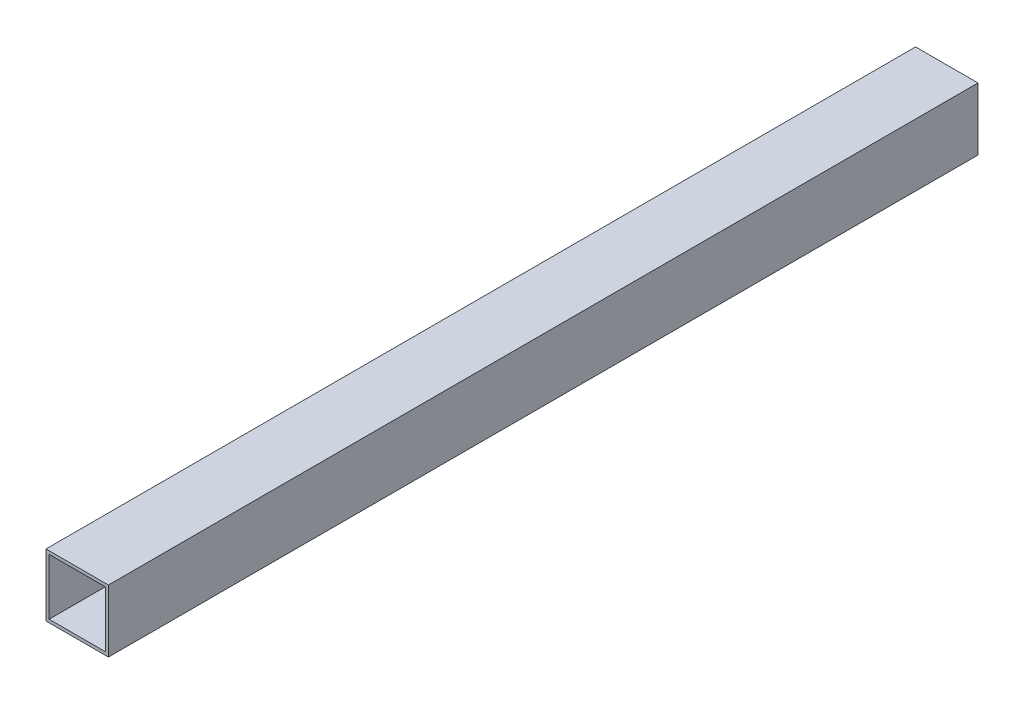
ISO-10303-21;
HEADER;
FILE_DESCRIPTION(('STEP AP214'),'2;1');
FILE_NAME('part.step','',(''),(''),'','','');
FILE_SCHEMA(('AUTOMOTIVE_DESIGN { 1 0 10303 214 1 1 1 1 }'));
ENDSEC;
DATA;
#1=APPLICATION_CONTEXT('core data for automotive mechanical design processes');
#2=APPLICATION_PROTOCOL_DEFINITION('international standard','automotive_design',2000,#1);
#3=PRODUCT_CONTEXT('',#1,'mechanical');
#4=PRODUCT('Part','Part','',(#3));
#5=PRODUCT_RELATED_PRODUCT_CATEGORY('part','',(#4));
#6=PRODUCT_DEFINITION_FORMATION('','',#4);
#7=PRODUCT_DEFINITION_CONTEXT('part definition',#1,'design');
#8=PRODUCT_DEFINITION('design','',#6,#7);
#9=PRODUCT_DEFINITION_SHAPE('','',#8);
#10=(LENGTH_UNIT() NAMED_UNIT(*) SI_UNIT(.MILLI.,.METRE.));
#11=(NAMED_UNIT(*) PLANE_ANGLE_UNIT() SI_UNIT($,.RADIAN.));
#12=(NAMED_UNIT(*) SI_UNIT($,.STERADIAN.) SOLID_ANGLE_UNIT());
#13=UNCERTAINTY_MEASURE_WITH_UNIT(LENGTH_MEASURE(1.E-05),#10,'distance_accuracy_value','');
#14=(GEOMETRIC_REPRESENTATION_CONTEXT(3) GLOBAL_UNCERTAINTY_ASSIGNED_CONTEXT((#13)) GLOBAL_UNIT_ASSIGNED_CONTEXT((#10,
#11,#12)) REPRESENTATION_CONTEXT('',''));
#15=CARTESIAN_POINT('',(0.,0.,0.));
#16=DIRECTION('',(0.,0.,1.));
#17=DIRECTION('',(1.,0.,0.));
#18=AXIS2_PLACEMENT_3D('',#15,#16,#17);
#19=CARTESIAN_POINT('',(0.,0.,278.56));
#20=DIRECTION('',(0.,0.,1.));
#21=DIRECTION('',(1.,0.,0.));
#22=AXIS2_PLACEMENT_3D('',#19,#20,#21);
#23=PLANE('',#22);
#24=DIRECTION('',(0.,1.,0.));
#25=VECTOR('',#24,1.);
#26=CARTESIAN_POINT('',(10.,10.,278.56));
#27=LINE('',#26,#25);
#28=CARTESIAN_POINT('',(10.,-10.,278.56));
#29=VERTEX_POINT('',#28);
#30=CARTESIAN_POINT('',(10.,10.,278.56));
#31=VERTEX_POINT('',#30);
#32=EDGE_CURVE('E140',#29,#31,#27,.T.);
#33=ORIENTED_EDGE('',*,*,#32,.T.);
#34=DIRECTION('',(-1.,0.,0.));
#35=VECTOR('',#34,1.);
#36=CARTESIAN_POINT('',(-10.,10.,278.56));
#37=LINE('',#36,#35);
#38=CARTESIAN_POINT('',(-10.,10.,278.56));
#39=VERTEX_POINT('',#38);
#40=EDGE_CURVE('E143',#31,#39,#37,.T.);
#41=ORIENTED_EDGE('',*,*,#40,.T.);
#42=DIRECTION('',(0.,-1.,0.));
#43=VECTOR('',#42,1.);
#44=CARTESIAN_POINT('',(-10.,10.,278.56));
#45=LINE('',#44,#43);
#46=CARTESIAN_POINT('',(-10.,-10.,278.56));
#47=VERTEX_POINT('',#46);
#48=EDGE_CURVE('E146',#39,#47,#45,.T.);
#49=ORIENTED_EDGE('',*,*,#48,.T.);
#50=DIRECTION('',(1.,0.,0.));
#51=VECTOR('',#50,1.);
#52=CARTESIAN_POINT('',(-10.,-10.,278.56));
#53=LINE('',#52,#51);
#54=EDGE_CURVE('E148',#47,#29,#53,.T.);
#55=ORIENTED_EDGE('',*,*,#54,.T.);
#56=EDGE_LOOP('',(#33,#41,#49,#55));
#57=FACE_BOUND('',#56,.T.);
#58=DIRECTION('',(1.,0.,0.));
#59=VECTOR('',#58,1.);
#60=CARTESIAN_POINT('',(-9.,-9.,278.56));
#61=LINE('',#60,#59);
#62=CARTESIAN_POINT('',(-9.,-9.,278.56));
#63=VERTEX_POINT('',#62);
#64=CARTESIAN_POINT('',(9.,-9.,278.56));
#65=VERTEX_POINT('',#64);
#66=EDGE_CURVE('E112',#63,#65,#61,.T.);
#67=ORIENTED_EDGE('',*,*,#66,.F.);
#68=DIRECTION('',(0.,-1.,0.));
#69=VECTOR('',#68,1.);
#70=CARTESIAN_POINT('',(-9.,9.00000000000001,278.56));
#71=LINE('',#70,#69);
#72=CARTESIAN_POINT('',(-9.,9.00000000000001,278.56));
#73=VERTEX_POINT('',#72);
#74=EDGE_CURVE('E104',#73,#63,#71,.T.);
#75=ORIENTED_EDGE('',*,*,#74,.F.);
#76=DIRECTION('',(-1.,0.,0.));
#77=VECTOR('',#76,1.);
#78=CARTESIAN_POINT('',(-9.,9.00000000000001,278.56));
#79=LINE('',#78,#77);
#80=CARTESIAN_POINT('',(9.,9.00000000000001,278.56));
#81=VERTEX_POINT('',#80);
#82=EDGE_CURVE('E126',#81,#73,#79,.T.);
#83=ORIENTED_EDGE('',*,*,#82,.F.);
#84=DIRECTION('',(0.,1.,0.));
#85=VECTOR('',#84,1.);
#86=CARTESIAN_POINT('',(9.,9.00000000000001,278.56));
#87=LINE('',#86,#85);
#88=EDGE_CURVE('E124',#65,#81,#87,.T.);
#89=ORIENTED_EDGE('',*,*,#88,.F.);
#90=EDGE_LOOP('',(#67,#75,#83,#89));
#91=FACE_BOUND('',#90,.T.);
#92=ADVANCED_FACE('F39',(#57,#91),#23,.T.);
#93=CARTESIAN_POINT('',(0.,0.,0.));
#94=DIRECTION('',(0.,0.,1.));
#95=DIRECTION('',(1.,0.,0.));
#96=AXIS2_PLACEMENT_3D('',#93,#94,#95);
#97=PLANE('',#96);
#98=DIRECTION('',(0.,1.,0.));
#99=VECTOR('',#98,1.);
#100=CARTESIAN_POINT('',(10.,10.,0.));
#101=LINE('',#100,#99);
#102=CARTESIAN_POINT('',(10.,-10.,0.));
#103=VERTEX_POINT('',#102);
#104=CARTESIAN_POINT('',(10.,10.,0.));
#105=VERTEX_POINT('',#104);
#106=EDGE_CURVE('E120',#103,#105,#101,.T.);
#107=ORIENTED_EDGE('',*,*,#106,.F.);
#108=DIRECTION('',(1.,0.,0.));
#109=VECTOR('',#108,1.);
#110=CARTESIAN_POINT('',(-10.,-10.,0.));
#111=LINE('',#110,#109);
#112=CARTESIAN_POINT('',(-10.,-10.,0.));
#113=VERTEX_POINT('',#112);
#114=EDGE_CURVE('E144',#113,#103,#111,.T.);
#115=ORIENTED_EDGE('',*,*,#114,.F.);
#116=DIRECTION('',(0.,-1.,0.));
#117=VECTOR('',#116,1.);
#118=CARTESIAN_POINT('',(-10.,10.,0.));
#119=LINE('',#118,#117);
#120=CARTESIAN_POINT('',(-10.,10.,0.));
#121=VERTEX_POINT('',#120);
#122=EDGE_CURVE('E155',#121,#113,#119,.T.);
#123=ORIENTED_EDGE('',*,*,#122,.F.);
#124=DIRECTION('',(-1.,0.,0.));
#125=VECTOR('',#124,1.);
#126=CARTESIAN_POINT('',(-10.,10.,0.));
#127=LINE('',#126,#125);
#128=EDGE_CURVE('E153',#105,#121,#127,.T.);
#129=ORIENTED_EDGE('',*,*,#128,.F.);
#130=EDGE_LOOP('',(#107,#115,#123,#129));
#131=FACE_BOUND('',#130,.T.);
#132=DIRECTION('',(0.,-1.,0.));
#133=VECTOR('',#132,1.);
#134=CARTESIAN_POINT('',(-9.,9.00000000000001,0.));
#135=LINE('',#134,#133);
#136=CARTESIAN_POINT('',(-9.,9.00000000000001,0.));
#137=VERTEX_POINT('',#136);
#138=CARTESIAN_POINT('',(-9.,-9.,0.));
#139=VERTEX_POINT('',#138);
#140=EDGE_CURVE('E62',#137,#139,#135,.T.);
#141=ORIENTED_EDGE('',*,*,#140,.T.);
#142=DIRECTION('',(1.,0.,0.));
#143=VECTOR('',#142,1.);
#144=CARTESIAN_POINT('',(-9.,-9.,0.));
#145=LINE('',#144,#143);
#146=CARTESIAN_POINT('',(9.,-9.,0.));
#147=VERTEX_POINT('',#146);
#148=EDGE_CURVE('E119',#139,#147,#145,.T.);
#149=ORIENTED_EDGE('',*,*,#148,.T.);
#150=DIRECTION('',(0.,1.,0.));
#151=VECTOR('',#150,1.);
#152=CARTESIAN_POINT('',(9.,9.00000000000001,0.));
#153=LINE('',#152,#151);
#154=CARTESIAN_POINT('',(9.,9.00000000000001,0.));
#155=VERTEX_POINT('',#154);
#156=EDGE_CURVE('E132',#147,#155,#153,.T.);
#157=ORIENTED_EDGE('',*,*,#156,.T.);
#158=DIRECTION('',(-1.,0.,0.));
#159=VECTOR('',#158,1.);
#160=CARTESIAN_POINT('',(-9.,9.00000000000001,0.));
#161=LINE('',#160,#159);
#162=EDGE_CURVE('E113',#155,#137,#161,.T.);
#163=ORIENTED_EDGE('',*,*,#162,.T.);
#164=EDGE_LOOP('',(#141,#149,#157,#163));
#165=FACE_BOUND('',#164,.T.);
#166=ADVANCED_FACE('F173',(#131,#165),#97,.F.);
#167=CARTESIAN_POINT('',(10.,10.,278.56));
#168=DIRECTION('',(-1.,0.,0.));
#169=DIRECTION('',(0.,-1.,0.));
#170=AXIS2_PLACEMENT_3D('',#167,#168,#169);
#171=PLANE('',#170);
#172=ORIENTED_EDGE('',*,*,#106,.T.);
#173=DIRECTION('',(0.,0.,-1.));
#174=VECTOR('',#173,1.);
#175=CARTESIAN_POINT('',(10.,10.,278.56));
#176=LINE('',#175,#174);
#177=EDGE_CURVE('E11',#31,#105,#176,.T.);
#178=ORIENTED_EDGE('',*,*,#177,.F.);
#179=ORIENTED_EDGE('',*,*,#32,.F.);
#180=DIRECTION('',(0.,0.,-1.));
#181=VECTOR('',#180,1.);
#182=CARTESIAN_POINT('',(10.,-10.,278.56));
#183=LINE('',#182,#181);
#184=EDGE_CURVE('E150',#29,#103,#183,.T.);
#185=ORIENTED_EDGE('',*,*,#184,.T.);
#186=EDGE_LOOP('',(#172,#178,#179,#185));
#187=FACE_BOUND('',#186,.T.);
#188=ADVANCED_FACE('F41',(#187),#171,.F.);
#189=CARTESIAN_POINT('',(-10.,10.,278.56));
#190=DIRECTION('',(0.,-1.,0.));
#191=DIRECTION('',(0.,0.,-1.));
#192=AXIS2_PLACEMENT_3D('',#189,#190,#191);
#193=PLANE('',#192);
#194=ORIENTED_EDGE('',*,*,#128,.T.);
#195=DIRECTION('',(0.,0.,-1.));
#196=VECTOR('',#195,1.);
#197=CARTESIAN_POINT('',(-10.,10.,278.56));
#198=LINE('',#197,#196);
#199=EDGE_CURVE('E47',#39,#121,#198,.T.);
#200=ORIENTED_EDGE('',*,*,#199,.F.);
#201=ORIENTED_EDGE('',*,*,#40,.F.);
#202=ORIENTED_EDGE('',*,*,#177,.T.);
#203=EDGE_LOOP('',(#194,#200,#201,#202));
#204=FACE_BOUND('',#203,.T.);
#205=ADVANCED_FACE('F183',(#204),#193,.F.);
#206=CARTESIAN_POINT('',(-10.,10.,278.56));
#207=DIRECTION('',(1.,0.,0.));
#208=DIRECTION('',(0.,1.,0.));
#209=AXIS2_PLACEMENT_3D('',#206,#207,#208);
#210=PLANE('',#209);
#211=ORIENTED_EDGE('',*,*,#122,.T.);
#212=DIRECTION('',(0.,0.,-1.));
#213=VECTOR('',#212,1.);
#214=CARTESIAN_POINT('',(-10.,-10.,278.56));
#215=LINE('',#214,#213);
#216=EDGE_CURVE('E160',#47,#113,#215,.T.);
#217=ORIENTED_EDGE('',*,*,#216,.F.);
#218=ORIENTED_EDGE('',*,*,#48,.F.);
#219=ORIENTED_EDGE('',*,*,#199,.T.);
#220=EDGE_LOOP('',(#211,#217,#218,#219));
#221=FACE_BOUND('',#220,.T.);
#222=ADVANCED_FACE('F167',(#221),#210,.F.);
#223=CARTESIAN_POINT('',(-10.,-10.,278.56));
#224=DIRECTION('',(0.,1.,0.));
#225=DIRECTION('',(0.,0.,1.));
#226=AXIS2_PLACEMENT_3D('',#223,#224,#225);
#227=PLANE('',#226);
#228=ORIENTED_EDGE('',*,*,#114,.T.);
#229=ORIENTED_EDGE('',*,*,#184,.F.);
#230=ORIENTED_EDGE('',*,*,#54,.F.);
#231=ORIENTED_EDGE('',*,*,#216,.T.);
#232=EDGE_LOOP('',(#228,#229,#230,#231));
#233=FACE_BOUND('',#232,.T.);
#234=ADVANCED_FACE('F177',(#233),#227,.F.);
#235=CARTESIAN_POINT('',(-9.,9.00000000000001,278.56));
#236=DIRECTION('',(1.,0.,0.));
#237=DIRECTION('',(0.,1.,0.));
#238=AXIS2_PLACEMENT_3D('',#235,#236,#237);
#239=PLANE('',#238);
#240=ORIENTED_EDGE('',*,*,#140,.F.);
#241=DIRECTION('',(0.,0.,-1.));
#242=VECTOR('',#241,1.);
#243=CARTESIAN_POINT('',(-9.,9.00000000000001,278.56));
#244=LINE('',#243,#242);
#245=EDGE_CURVE('E108',#73,#137,#244,.T.);
#246=ORIENTED_EDGE('',*,*,#245,.F.);
#247=ORIENTED_EDGE('',*,*,#74,.T.);
#248=DIRECTION('',(0.,0.,-1.));
#249=VECTOR('',#248,1.);
#250=CARTESIAN_POINT('',(-9.,-9.,278.56));
#251=LINE('',#250,#249);
#252=EDGE_CURVE('E107',#63,#139,#251,.T.);
#253=ORIENTED_EDGE('',*,*,#252,.T.);
#254=EDGE_LOOP('',(#240,#246,#247,#253));
#255=FACE_BOUND('',#254,.T.);
#256=ADVANCED_FACE('F106',(#255),#239,.T.);
#257=CARTESIAN_POINT('',(-9.,-9.,278.56));
#258=DIRECTION('',(0.,1.,0.));
#259=DIRECTION('',(-1.,0.,0.));
#260=AXIS2_PLACEMENT_3D('',#257,#258,#259);
#261=PLANE('',#260);
#262=ORIENTED_EDGE('',*,*,#148,.F.);
#263=ORIENTED_EDGE('',*,*,#252,.F.);
#264=ORIENTED_EDGE('',*,*,#66,.T.);
#265=DIRECTION('',(0.,0.,-1.));
#266=VECTOR('',#265,1.);
#267=CARTESIAN_POINT('',(9.,-9.,278.56));
#268=LINE('',#267,#266);
#269=EDGE_CURVE('E121',#65,#147,#268,.T.);
#270=ORIENTED_EDGE('',*,*,#269,.T.);
#271=EDGE_LOOP('',(#262,#263,#264,#270));
#272=FACE_BOUND('',#271,.T.);
#273=ADVANCED_FACE('F116',(#272),#261,.T.);
#274=CARTESIAN_POINT('',(9.,9.00000000000001,278.56));
#275=DIRECTION('',(-1.,0.,0.));
#276=DIRECTION('',(0.,-1.,0.));
#277=AXIS2_PLACEMENT_3D('',#274,#275,#276);
#278=PLANE('',#277);
#279=ORIENTED_EDGE('',*,*,#156,.F.);
#280=ORIENTED_EDGE('',*,*,#269,.F.);
#281=ORIENTED_EDGE('',*,*,#88,.T.);
#282=DIRECTION('',(0.,0.,-1.));
#283=VECTOR('',#282,1.);
#284=CARTESIAN_POINT('',(9.,9.00000000000001,278.56));
#285=LINE('',#284,#283);
#286=EDGE_CURVE('E54',#81,#155,#285,.T.);
#287=ORIENTED_EDGE('',*,*,#286,.T.);
#288=EDGE_LOOP('',(#279,#280,#281,#287));
#289=FACE_BOUND('',#288,.T.);
#290=ADVANCED_FACE('F206',(#289),#278,.T.);
#291=CARTESIAN_POINT('',(-9.,9.00000000000001,278.56));
#292=DIRECTION('',(0.,-1.,0.));
#293=DIRECTION('',(0.,0.,-1.));
#294=AXIS2_PLACEMENT_3D('',#291,#292,#293);
#295=PLANE('',#294);
#296=ORIENTED_EDGE('',*,*,#162,.F.);
#297=ORIENTED_EDGE('',*,*,#286,.F.);
#298=ORIENTED_EDGE('',*,*,#82,.T.);
#299=ORIENTED_EDGE('',*,*,#245,.T.);
#300=EDGE_LOOP('',(#296,#297,#298,#299));
#301=FACE_BOUND('',#300,.T.);
#302=ADVANCED_FACE('F210',(#301),#295,.T.);
#303=CLOSED_SHELL('',(#92,#166,#188,#205,#222,#234,#256,#273,#290,#302));
#304=MANIFOLD_SOLID_BREP('B2',#303);
#305=ADVANCED_BREP_SHAPE_REPRESENTATION('',(#18,#304),#14);
#306=SHAPE_DEFINITION_REPRESENTATION(#9,#305);
ENDSEC;
END-ISO-10303-21;
